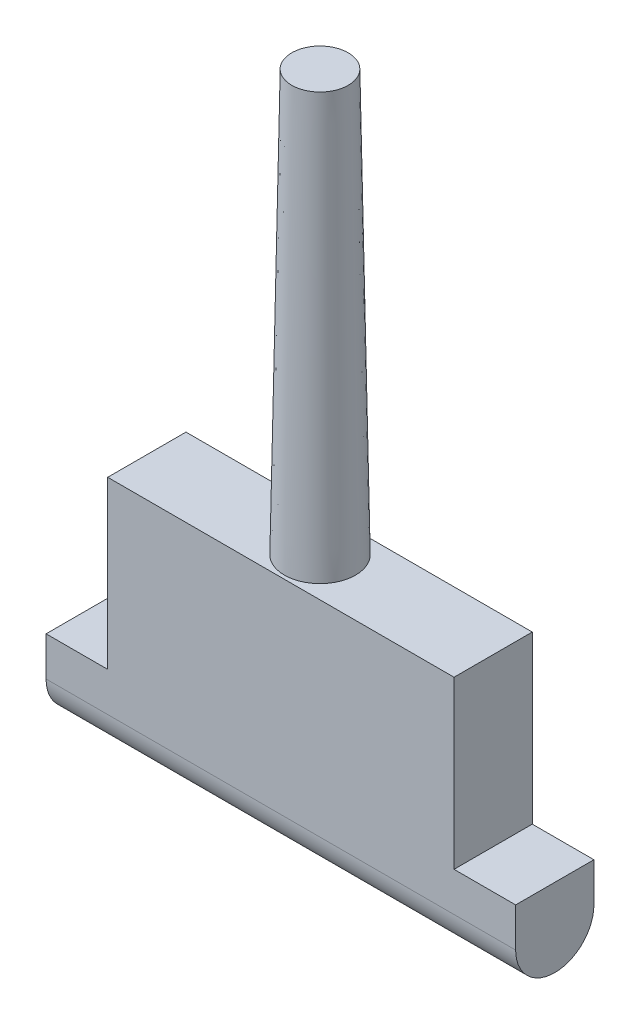
ISO-10303-21;
HEADER;
FILE_DESCRIPTION(('STEP AP214'),'2;1');
FILE_NAME('part.step','',(''),(''),'','','');
FILE_SCHEMA(('AUTOMOTIVE_DESIGN { 1 0 10303 214 1 1 1 1 }'));
ENDSEC;
DATA;
#1=APPLICATION_CONTEXT('core data for automotive mechanical design processes');
#2=APPLICATION_PROTOCOL_DEFINITION('international standard','automotive_design',2000,#1);
#3=PRODUCT_CONTEXT('',#1,'mechanical');
#4=PRODUCT('Part','Part','',(#3));
#5=PRODUCT_RELATED_PRODUCT_CATEGORY('part','',(#4));
#6=PRODUCT_DEFINITION_FORMATION('','',#4);
#7=PRODUCT_DEFINITION_CONTEXT('part definition',#1,'design');
#8=PRODUCT_DEFINITION('design','',#6,#7);
#9=PRODUCT_DEFINITION_SHAPE('','',#8);
#10=(LENGTH_UNIT() NAMED_UNIT(*) SI_UNIT(.MILLI.,.METRE.));
#11=(NAMED_UNIT(*) PLANE_ANGLE_UNIT() SI_UNIT($,.RADIAN.));
#12=(NAMED_UNIT(*) SI_UNIT($,.STERADIAN.) SOLID_ANGLE_UNIT());
#13=UNCERTAINTY_MEASURE_WITH_UNIT(LENGTH_MEASURE(1.E-05),#10,'distance_accuracy_value','');
#14=(GEOMETRIC_REPRESENTATION_CONTEXT(3) GLOBAL_UNCERTAINTY_ASSIGNED_CONTEXT((#13)) GLOBAL_UNIT_ASSIGNED_CONTEXT((#10,
#11,#12)) REPRESENTATION_CONTEXT('',''));
#15=CARTESIAN_POINT('',(0.,0.,0.));
#16=DIRECTION('',(0.,0.,1.));
#17=DIRECTION('',(1.,0.,0.));
#18=AXIS2_PLACEMENT_3D('',#15,#16,#17);
#19=CARTESIAN_POINT('',(19.05,3.175,3.175));
#20=DIRECTION('',(0.,-1.,0.));
#21=DIRECTION('',(0.,0.,-1.));
#22=AXIS2_PLACEMENT_3D('',#19,#20,#21);
#23=PLANE('',#22);
#24=DIRECTION('',(0.,0.,-1.));
#25=VECTOR('',#24,1.);
#26=CARTESIAN_POINT('',(-14.05,3.175,3.175));
#27=LINE('',#26,#25);
#28=CARTESIAN_POINT('',(-14.05,3.175,3.175));
#29=VERTEX_POINT('',#28);
#30=CARTESIAN_POINT('',(-14.05,3.175,-3.175));
#31=VERTEX_POINT('',#30);
#32=EDGE_CURVE('E46',#29,#31,#27,.T.);
#33=ORIENTED_EDGE('',*,*,#32,.T.);
#34=DIRECTION('',(-1.,0.,0.));
#35=VECTOR('',#34,1.);
#36=CARTESIAN_POINT('',(19.05,3.175,-3.175));
#37=LINE('',#36,#35);
#38=CARTESIAN_POINT('',(-19.05,3.175,-3.175));
#39=VERTEX_POINT('',#38);
#40=EDGE_CURVE('E130',#31,#39,#37,.T.);
#41=ORIENTED_EDGE('',*,*,#40,.T.);
#42=DIRECTION('',(0.,0.,1.));
#43=VECTOR('',#42,1.);
#44=CARTESIAN_POINT('',(-19.05,3.175,3.175));
#45=LINE('',#44,#43);
#46=CARTESIAN_POINT('',(-19.05,3.175,3.175));
#47=VERTEX_POINT('',#46);
#48=EDGE_CURVE('E150',#39,#47,#45,.T.);
#49=ORIENTED_EDGE('',*,*,#48,.T.);
#50=DIRECTION('',(-1.,0.,0.));
#51=VECTOR('',#50,1.);
#52=CARTESIAN_POINT('',(19.05,3.175,3.175));
#53=LINE('',#52,#51);
#54=EDGE_CURVE('E131',#29,#47,#53,.T.);
#55=ORIENTED_EDGE('',*,*,#54,.F.);
#56=EDGE_LOOP('',(#33,#41,#49,#55));
#57=FACE_BOUND('',#56,.T.);
#58=ADVANCED_FACE('F31',(#57),#23,.F.);
#59=DIRECTION('',(0.,0.,-1.));
#60=VECTOR('',#59,1.);
#61=CARTESIAN_POINT('',(14.05,3.175,3.175));
#62=LINE('',#61,#60);
#63=CARTESIAN_POINT('',(14.05,3.175,3.175));
#64=VERTEX_POINT('',#63);
#65=CARTESIAN_POINT('',(14.05,3.175,-3.175));
#66=VERTEX_POINT('',#65);
#67=EDGE_CURVE('E106',#64,#66,#62,.T.);
#68=ORIENTED_EDGE('',*,*,#67,.F.);
#69=CARTESIAN_POINT('',(19.05,3.175,3.175));
#70=VERTEX_POINT('',#69);
#71=EDGE_CURVE('E121',#70,#64,#53,.T.);
#72=ORIENTED_EDGE('',*,*,#71,.F.);
#73=DIRECTION('',(0.,0.,1.));
#74=VECTOR('',#73,1.);
#75=CARTESIAN_POINT('',(19.05,3.175,3.175));
#76=LINE('',#75,#74);
#77=CARTESIAN_POINT('',(19.05,3.175,-3.175));
#78=VERTEX_POINT('',#77);
#79=EDGE_CURVE('E168',#78,#70,#76,.T.);
#80=ORIENTED_EDGE('',*,*,#79,.F.);
#81=EDGE_CURVE('E124',#78,#66,#37,.T.);
#82=ORIENTED_EDGE('',*,*,#81,.T.);
#83=EDGE_LOOP('',(#68,#72,#80,#82));
#84=FACE_BOUND('',#83,.T.);
#85=ADVANCED_FACE('F119',(#84),#23,.F.);
#86=CARTESIAN_POINT('',(19.05,0.,0.));
#87=DIRECTION('',(-1.,0.,0.));
#88=DIRECTION('',(0.,0.,1.));
#89=AXIS2_PLACEMENT_3D('',#86,#87,#88);
#90=CYLINDRICAL_SURFACE('',#89,3.175);
#91=CARTESIAN_POINT('',(-19.05,0.,0.));
#92=DIRECTION('',(1.,0.,0.));
#93=DIRECTION('',(0.,0.,-1.));
#94=AXIS2_PLACEMENT_3D('',#91,#92,#93);
#95=CIRCLE('',#94,3.175);
#96=CARTESIAN_POINT('',(-19.05,0.,3.175));
#97=VERTEX_POINT('',#96);
#98=CARTESIAN_POINT('',(-19.05,0.,-3.175));
#99=VERTEX_POINT('',#98);
#100=EDGE_CURVE('E148',#97,#99,#95,.T.);
#101=ORIENTED_EDGE('',*,*,#100,.T.);
#102=DIRECTION('',(-1.,0.,0.));
#103=VECTOR('',#102,1.);
#104=CARTESIAN_POINT('',(19.05,0.,-3.175));
#105=LINE('',#104,#103);
#106=CARTESIAN_POINT('',(0.,0.,-3.175));
#107=VERTEX_POINT('',#106);
#108=EDGE_CURVE('E54',#107,#99,#105,.T.);
#109=ORIENTED_EDGE('',*,*,#108,.F.);
#110=CARTESIAN_POINT('',(19.05,0.,-3.175));
#111=VERTEX_POINT('',#110);
#112=EDGE_CURVE('E39',#111,#107,#105,.T.);
#113=ORIENTED_EDGE('',*,*,#112,.F.);
#114=CARTESIAN_POINT('',(19.05,0.,0.));
#115=DIRECTION('',(1.,0.,0.));
#116=DIRECTION('',(0.,0.,-1.));
#117=AXIS2_PLACEMENT_3D('',#114,#115,#116);
#118=CIRCLE('',#117,3.175);
#119=CARTESIAN_POINT('',(19.05,0.,3.175));
#120=VERTEX_POINT('',#119);
#121=EDGE_CURVE('E162',#120,#111,#118,.T.);
#122=ORIENTED_EDGE('',*,*,#121,.F.);
#123=DIRECTION('',(-1.,0.,0.));
#124=VECTOR('',#123,1.);
#125=CARTESIAN_POINT('',(19.05,0.,3.175));
#126=LINE('',#125,#124);
#127=CARTESIAN_POINT('',(0.,0.,3.175));
#128=VERTEX_POINT('',#127);
#129=EDGE_CURVE('E134',#120,#128,#126,.T.);
#130=ORIENTED_EDGE('',*,*,#129,.T.);
#131=EDGE_CURVE('E153',#128,#97,#126,.T.);
#132=ORIENTED_EDGE('',*,*,#131,.T.);
#133=EDGE_LOOP('',(#101,#109,#113,#122,#130,#132));
#134=FACE_BOUND('',#133,.T.);
#135=ADVANCED_FACE('F33',(#134),#90,.T.);
#136=CARTESIAN_POINT('',(19.05,3.175,-3.175));
#137=DIRECTION('',(0.,0.,1.));
#138=DIRECTION('',(0.,-1.,0.));
#139=AXIS2_PLACEMENT_3D('',#136,#137,#138);
#140=PLANE('',#139);
#141=DIRECTION('',(0.,1.,0.));
#142=VECTOR('',#141,1.);
#143=CARTESIAN_POINT('',(-19.05,3.175,-3.175));
#144=LINE('',#143,#142);
#145=EDGE_CURVE('E142',#99,#39,#144,.T.);
#146=ORIENTED_EDGE('',*,*,#145,.T.);
#147=ORIENTED_EDGE('',*,*,#40,.F.);
#148=DIRECTION('',(0.,-1.,0.));
#149=VECTOR('',#148,1.);
#150=CARTESIAN_POINT('',(-14.05,3.175,-3.175));
#151=LINE('',#150,#149);
#152=CARTESIAN_POINT('',(-14.05,16.675,-3.175));
#153=VERTEX_POINT('',#152);
#154=EDGE_CURVE('E283',#153,#31,#151,.T.);
#155=ORIENTED_EDGE('',*,*,#154,.F.);
#156=DIRECTION('',(-1.,0.,0.));
#157=VECTOR('',#156,1.);
#158=CARTESIAN_POINT('',(-14.05,16.675,-3.175));
#159=LINE('',#158,#157);
#160=CARTESIAN_POINT('',(14.05,16.675,-3.175));
#161=VERTEX_POINT('',#160);
#162=EDGE_CURVE('E293',#161,#153,#159,.T.);
#163=ORIENTED_EDGE('',*,*,#162,.F.);
#164=DIRECTION('',(0.,1.,0.));
#165=VECTOR('',#164,1.);
#166=CARTESIAN_POINT('',(14.05,3.175,-3.175));
#167=LINE('',#166,#165);
#168=EDGE_CURVE('E287',#66,#161,#167,.T.);
#169=ORIENTED_EDGE('',*,*,#168,.F.);
#170=ORIENTED_EDGE('',*,*,#81,.F.);
#171=DIRECTION('',(0.,1.,0.));
#172=VECTOR('',#171,1.);
#173=CARTESIAN_POINT('',(19.05,3.175,-3.175));
#174=LINE('',#173,#172);
#175=EDGE_CURVE('E164',#111,#78,#174,.T.);
#176=ORIENTED_EDGE('',*,*,#175,.F.);
#177=ORIENTED_EDGE('',*,*,#112,.T.);
#178=ORIENTED_EDGE('',*,*,#108,.T.);
#179=EDGE_LOOP('',(#146,#147,#155,#163,#169,#170,#176,#177,#178));
#180=FACE_BOUND('',#179,.T.);
#181=ADVANCED_FACE('F140',(#180),#140,.F.);
#182=CARTESIAN_POINT('',(19.05,0.,3.175));
#183=DIRECTION('',(0.,0.,-1.));
#184=DIRECTION('',(0.,1.,0.));
#185=AXIS2_PLACEMENT_3D('',#182,#183,#184);
#186=PLANE('',#185);
#187=DIRECTION('',(0.,-1.,0.));
#188=VECTOR('',#187,1.);
#189=CARTESIAN_POINT('',(-19.05,0.,3.175));
#190=LINE('',#189,#188);
#191=EDGE_CURVE('E161',#47,#97,#190,.T.);
#192=ORIENTED_EDGE('',*,*,#191,.T.);
#193=ORIENTED_EDGE('',*,*,#131,.F.);
#194=ORIENTED_EDGE('',*,*,#129,.F.);
#195=DIRECTION('',(0.,-1.,0.));
#196=VECTOR('',#195,1.);
#197=CARTESIAN_POINT('',(19.05,0.,3.175));
#198=LINE('',#197,#196);
#199=EDGE_CURVE('E129',#70,#120,#198,.T.);
#200=ORIENTED_EDGE('',*,*,#199,.F.);
#201=ORIENTED_EDGE('',*,*,#71,.T.);
#202=DIRECTION('',(0.,1.,0.));
#203=VECTOR('',#202,1.);
#204=CARTESIAN_POINT('',(14.05,3.175,3.175));
#205=LINE('',#204,#203);
#206=CARTESIAN_POINT('',(14.05,16.675,3.175));
#207=VERTEX_POINT('',#206);
#208=EDGE_CURVE('E103',#64,#207,#205,.T.);
#209=ORIENTED_EDGE('',*,*,#208,.T.);
#210=DIRECTION('',(-1.,0.,0.));
#211=VECTOR('',#210,1.);
#212=CARTESIAN_POINT('',(-14.05,16.675,3.175));
#213=LINE('',#212,#211);
#214=CARTESIAN_POINT('',(-14.05,16.675,3.175));
#215=VERTEX_POINT('',#214);
#216=EDGE_CURVE('E113',#207,#215,#213,.T.);
#217=ORIENTED_EDGE('',*,*,#216,.T.);
#218=DIRECTION('',(0.,-1.,0.));
#219=VECTOR('',#218,1.);
#220=CARTESIAN_POINT('',(-14.05,3.175,3.175));
#221=LINE('',#220,#219);
#222=EDGE_CURVE('E114',#215,#29,#221,.T.);
#223=ORIENTED_EDGE('',*,*,#222,.T.);
#224=ORIENTED_EDGE('',*,*,#54,.T.);
#225=EDGE_LOOP('',(#192,#193,#194,#200,#201,#209,#217,#223,#224));
#226=FACE_BOUND('',#225,.T.);
#227=ADVANCED_FACE('F127',(#226),#186,.F.);
#228=CARTESIAN_POINT('',(19.05,0.,0.));
#229=DIRECTION('',(1.,0.,0.));
#230=DIRECTION('',(0.,0.,-1.));
#231=AXIS2_PLACEMENT_3D('',#228,#229,#230);
#232=PLANE('',#231);
#233=ORIENTED_EDGE('',*,*,#121,.T.);
#234=ORIENTED_EDGE('',*,*,#175,.T.);
#235=ORIENTED_EDGE('',*,*,#79,.T.);
#236=ORIENTED_EDGE('',*,*,#199,.T.);
#237=EDGE_LOOP('',(#233,#234,#235,#236));
#238=FACE_BOUND('',#237,.T.);
#239=ADVANCED_FACE('F171',(#238),#232,.T.);
#240=CARTESIAN_POINT('',(-19.05,0.,0.));
#241=DIRECTION('',(1.,0.,0.));
#242=DIRECTION('',(0.,0.,-1.));
#243=AXIS2_PLACEMENT_3D('',#240,#241,#242);
#244=PLANE('',#243);
#245=ORIENTED_EDGE('',*,*,#100,.F.);
#246=ORIENTED_EDGE('',*,*,#191,.F.);
#247=ORIENTED_EDGE('',*,*,#48,.F.);
#248=ORIENTED_EDGE('',*,*,#145,.F.);
#249=EDGE_LOOP('',(#245,#246,#247,#248));
#250=FACE_BOUND('',#249,.T.);
#251=ADVANCED_FACE('F146',(#250),#244,.F.);
#252=CARTESIAN_POINT('',(-14.05,16.675,3.175));
#253=DIRECTION('',(0.,-1.,0.));
#254=DIRECTION('',(0.,0.,-1.));
#255=AXIS2_PLACEMENT_3D('',#252,#253,#254);
#256=PLANE('',#255);
#257=ORIENTED_EDGE('',*,*,#162,.T.);
#258=DIRECTION('',(0.,0.,-1.));
#259=VECTOR('',#258,1.);
#260=CARTESIAN_POINT('',(-14.05,16.675,3.175));
#261=LINE('',#260,#259);
#262=EDGE_CURVE('E285',#215,#153,#261,.T.);
#263=ORIENTED_EDGE('',*,*,#262,.F.);
#264=ORIENTED_EDGE('',*,*,#216,.F.);
#265=DIRECTION('',(0.,0.,-1.));
#266=VECTOR('',#265,1.);
#267=CARTESIAN_POINT('',(14.05,16.675,3.175));
#268=LINE('',#267,#266);
#269=EDGE_CURVE('E109',#207,#161,#268,.T.);
#270=ORIENTED_EDGE('',*,*,#269,.T.);
#271=EDGE_LOOP('',(#257,#263,#264,#270));
#272=FACE_BOUND('',#271,.T.);
#273=CARTESIAN_POINT('',(0.,16.675,0.));
#274=DIRECTION('',(0.,-1.,0.));
#275=DIRECTION('',(0.,0.,-1.));
#276=AXIS2_PLACEMENT_3D('',#273,#274,#275);
#277=CIRCLE('',#276,2.88393679232197);
#278=CARTESIAN_POINT('',(0.,16.675,-2.88393679232197));
#279=VERTEX_POINT('',#278);
#280=EDGE_CURVE('E11',#279,#279,#277,.T.);
#281=ORIENTED_EDGE('',*,*,#280,.T.);
#282=EDGE_LOOP('',(#281));
#283=FACE_BOUND('',#282,.T.);
#284=ADVANCED_FACE('F178',(#272,#283),#256,.F.);
#285=CARTESIAN_POINT('',(-14.05,3.175,3.175));
#286=DIRECTION('',(1.,0.,0.));
#287=DIRECTION('',(0.,0.,-1.));
#288=AXIS2_PLACEMENT_3D('',#285,#286,#287);
#289=PLANE('',#288);
#290=ORIENTED_EDGE('',*,*,#154,.T.);
#291=ORIENTED_EDGE('',*,*,#32,.F.);
#292=ORIENTED_EDGE('',*,*,#222,.F.);
#293=ORIENTED_EDGE('',*,*,#262,.T.);
#294=EDGE_LOOP('',(#290,#291,#292,#293));
#295=FACE_BOUND('',#294,.T.);
#296=ADVANCED_FACE('F224',(#295),#289,.F.);
#297=CARTESIAN_POINT('',(14.05,3.175,3.175));
#298=DIRECTION('',(-1.,0.,0.));
#299=DIRECTION('',(0.,0.,1.));
#300=AXIS2_PLACEMENT_3D('',#297,#298,#299);
#301=PLANE('',#300);
#302=ORIENTED_EDGE('',*,*,#168,.T.);
#303=ORIENTED_EDGE('',*,*,#269,.F.);
#304=ORIENTED_EDGE('',*,*,#208,.F.);
#305=ORIENTED_EDGE('',*,*,#67,.T.);
#306=EDGE_LOOP('',(#302,#303,#304,#305));
#307=FACE_BOUND('',#306,.T.);
#308=ADVANCED_FACE('F105',(#307),#301,.F.);
#309=CARTESIAN_POINT('',(0.,50.8,0.));
#310=DIRECTION('',(0.,1.,0.));
#311=DIRECTION('',(0.,0.,1.));
#312=AXIS2_PLACEMENT_3D('',#309,#310,#311);
#313=PLANE('',#312);
#314=CARTESIAN_POINT('',(0.,50.8,0.));
#315=DIRECTION('',(0.,1.,0.));
#316=DIRECTION('',(0.,0.,1.));
#317=AXIS2_PLACEMENT_3D('',#314,#315,#316);
#318=CIRCLE('',#317,2.28828270164654);
#319=CARTESIAN_POINT('',(0.,50.8,2.28828270164654));
#320=VERTEX_POINT('',#319);
#321=EDGE_CURVE('E154',#320,#320,#318,.T.);
#322=ORIENTED_EDGE('',*,*,#321,.T.);
#323=EDGE_LOOP('',(#322));
#324=FACE_BOUND('',#323,.T.);
#325=ADVANCED_FACE('F242',(#324),#313,.T.);
#326=CARTESIAN_POINT('',(0.,0.,0.));
#327=DIRECTION('',(0.,-1.,0.));
#328=DIRECTION('',(0.,0.,1.));
#329=AXIS2_PLACEMENT_3D('',#326,#327,#328);
#330=CONICAL_SURFACE('',#329,3.175,0.0174532925199433);
#331=ORIENTED_EDGE('',*,*,#321,.F.);
#332=EDGE_LOOP('',(#331));
#333=FACE_BOUND('',#332,.T.);
#334=ORIENTED_EDGE('',*,*,#280,.F.);
#335=EDGE_LOOP('',(#334));
#336=FACE_BOUND('',#335,.T.);
#337=ADVANCED_FACE('F248',(#333,#336),#330,.T.);
#338=CLOSED_SHELL('',(#58,#85,#135,#181,#227,#239,#251,#284,#296,#308,#325,#337));
#339=MANIFOLD_SOLID_BREP('B2',#338);
#340=ADVANCED_BREP_SHAPE_REPRESENTATION('',(#18,#339),#14);
#341=SHAPE_DEFINITION_REPRESENTATION(#9,#340);
ENDSEC;
END-ISO-10303-21;
